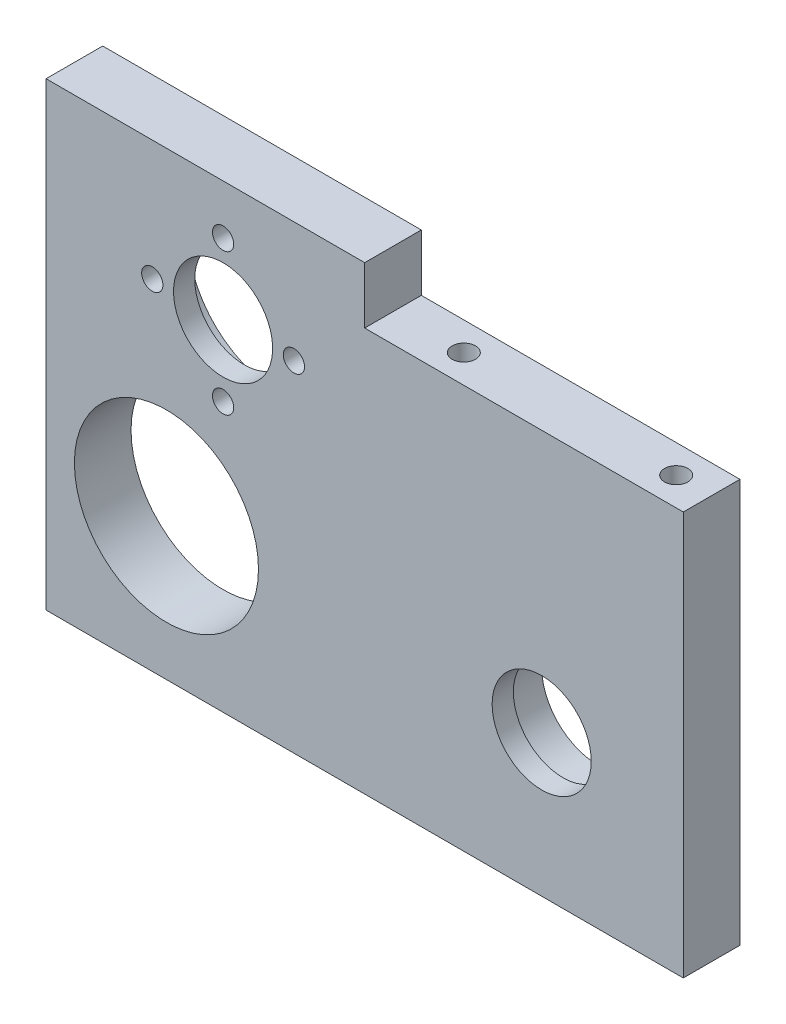
ISO-10303-21;
HEADER;
FILE_DESCRIPTION(('STEP AP214'),'2;1');
FILE_NAME('part.step','',(''),(''),'','','');
FILE_SCHEMA(('AUTOMOTIVE_DESIGN { 1 0 10303 214 1 1 1 1 }'));
ENDSEC;
DATA;
#1=APPLICATION_CONTEXT('core data for automotive mechanical design processes');
#2=APPLICATION_PROTOCOL_DEFINITION('international standard','automotive_design',2000,#1);
#3=PRODUCT_CONTEXT('',#1,'mechanical');
#4=PRODUCT('Part','Part','',(#3));
#5=PRODUCT_RELATED_PRODUCT_CATEGORY('part','',(#4));
#6=PRODUCT_DEFINITION_FORMATION('','',#4);
#7=PRODUCT_DEFINITION_CONTEXT('part definition',#1,'design');
#8=PRODUCT_DEFINITION('design','',#6,#7);
#9=PRODUCT_DEFINITION_SHAPE('','',#8);
#10=(LENGTH_UNIT() NAMED_UNIT(*) SI_UNIT(.MILLI.,.METRE.));
#11=(NAMED_UNIT(*) PLANE_ANGLE_UNIT() SI_UNIT($,.RADIAN.));
#12=(NAMED_UNIT(*) SI_UNIT($,.STERADIAN.) SOLID_ANGLE_UNIT());
#13=UNCERTAINTY_MEASURE_WITH_UNIT(LENGTH_MEASURE(1.E-05),#10,'distance_accuracy_value','');
#14=(GEOMETRIC_REPRESENTATION_CONTEXT(3) GLOBAL_UNCERTAINTY_ASSIGNED_CONTEXT((#13)) GLOBAL_UNIT_ASSIGNED_CONTEXT((#10,
#11,#12)) REPRESENTATION_CONTEXT('',''));
#15=CARTESIAN_POINT('',(0.,0.,0.));
#16=DIRECTION('',(0.,0.,1.));
#17=DIRECTION('',(1.,0.,0.));
#18=AXIS2_PLACEMENT_3D('',#15,#16,#17);
#19=CARTESIAN_POINT('',(70.,20.,8.));
#20=DIRECTION('',(0.,0.,-1.));
#21=DIRECTION('',(-1.,0.,0.));
#22=AXIS2_PLACEMENT_3D('',#19,#20,#21);
#23=CYLINDRICAL_SURFACE('',#22,7.);
#24=CARTESIAN_POINT('',(70.,20.,8.));
#25=DIRECTION('',(0.,0.,1.));
#26=DIRECTION('',(1.,0.,0.));
#27=AXIS2_PLACEMENT_3D('',#24,#25,#26);
#28=CIRCLE('',#27,7.);
#29=CARTESIAN_POINT('',(77.,20.,8.));
#30=VERTEX_POINT('',#29);
#31=EDGE_CURVE('E128',#30,#30,#28,.T.);
#32=ORIENTED_EDGE('',*,*,#31,.T.);
#33=EDGE_LOOP('',(#32));
#34=FACE_BOUND('',#33,.T.);
#35=CARTESIAN_POINT('',(70.,20.,5.));
#36=DIRECTION('',(0.,0.,-1.));
#37=DIRECTION('',(-1.,0.,0.));
#38=AXIS2_PLACEMENT_3D('',#35,#36,#37);
#39=CIRCLE('',#38,7.);
#40=CARTESIAN_POINT('',(63.,20.,5.));
#41=VERTEX_POINT('',#40);
#42=EDGE_CURVE('E36',#41,#41,#39,.T.);
#43=ORIENTED_EDGE('',*,*,#42,.T.);
#44=EDGE_LOOP('',(#43));
#45=FACE_BOUND('',#44,.T.);
#46=ADVANCED_FACE('F32',(#34,#45),#23,.F.);
#47=CARTESIAN_POINT('',(0.,0.,8.));
#48=DIRECTION('',(0.,0.,-1.));
#49=DIRECTION('',(-1.,0.,0.));
#50=AXIS2_PLACEMENT_3D('',#47,#48,#49);
#51=PLANE('',#50);
#52=CARTESIAN_POINT('',(25.,58.,8.));
#53=DIRECTION('',(0.,0.,-1.));
#54=DIRECTION('',(-1.,0.,0.));
#55=AXIS2_PLACEMENT_3D('',#52,#53,#54);
#56=CIRCLE('',#55,1.5);
#57=CARTESIAN_POINT('',(23.5,58.,8.));
#58=VERTEX_POINT('',#57);
#59=EDGE_CURVE('E168',#58,#58,#56,.T.);
#60=ORIENTED_EDGE('',*,*,#59,.T.);
#61=EDGE_LOOP('',(#60));
#62=FACE_BOUND('',#61,.T.);
#63=CARTESIAN_POINT('',(35.,48.,8.));
#64=DIRECTION('',(0.,0.,-1.));
#65=DIRECTION('',(-1.,0.,0.));
#66=AXIS2_PLACEMENT_3D('',#63,#64,#65);
#67=CIRCLE('',#66,1.5);
#68=CARTESIAN_POINT('',(33.5,48.,8.));
#69=VERTEX_POINT('',#68);
#70=EDGE_CURVE('E161',#69,#69,#67,.T.);
#71=ORIENTED_EDGE('',*,*,#70,.T.);
#72=EDGE_LOOP('',(#71));
#73=FACE_BOUND('',#72,.T.);
#74=CARTESIAN_POINT('',(25.,38.,8.));
#75=DIRECTION('',(0.,0.,-1.));
#76=DIRECTION('',(-1.,0.,0.));
#77=AXIS2_PLACEMENT_3D('',#74,#75,#76);
#78=CIRCLE('',#77,1.5);
#79=CARTESIAN_POINT('',(23.5,38.,8.));
#80=VERTEX_POINT('',#79);
#81=EDGE_CURVE('E181',#80,#80,#78,.T.);
#82=ORIENTED_EDGE('',*,*,#81,.T.);
#83=EDGE_LOOP('',(#82));
#84=FACE_BOUND('',#83,.T.);
#85=CARTESIAN_POINT('',(15.,48.,8.));
#86=DIRECTION('',(0.,0.,-1.));
#87=DIRECTION('',(-1.,0.,0.));
#88=AXIS2_PLACEMENT_3D('',#85,#86,#87);
#89=CIRCLE('',#88,1.5);
#90=CARTESIAN_POINT('',(13.5,48.,8.));
#91=VERTEX_POINT('',#90);
#92=EDGE_CURVE('E174',#91,#91,#89,.T.);
#93=ORIENTED_EDGE('',*,*,#92,.T.);
#94=EDGE_LOOP('',(#93));
#95=FACE_BOUND('',#94,.T.);
#96=CARTESIAN_POINT('',(25.,48.,8.));
#97=DIRECTION('',(0.,0.,-1.));
#98=DIRECTION('',(-1.,0.,0.));
#99=AXIS2_PLACEMENT_3D('',#96,#97,#98);
#100=CIRCLE('',#99,7.);
#101=CARTESIAN_POINT('',(18.,48.,8.));
#102=VERTEX_POINT('',#101);
#103=EDGE_CURVE('E186',#102,#102,#100,.T.);
#104=ORIENTED_EDGE('',*,*,#103,.T.);
#105=EDGE_LOOP('',(#104));
#106=FACE_BOUND('',#105,.T.);
#107=DIRECTION('',(-1.,0.,0.));
#108=VECTOR('',#107,1.);
#109=CARTESIAN_POINT('',(90.,57.,8.));
#110=LINE('',#109,#108);
#111=CARTESIAN_POINT('',(90.,57.,8.));
#112=VERTEX_POINT('',#111);
#113=CARTESIAN_POINT('',(45.,57.,8.));
#114=VERTEX_POINT('',#113);
#115=EDGE_CURVE('E95',#112,#114,#110,.T.);
#116=ORIENTED_EDGE('',*,*,#115,.T.);
#117=DIRECTION('',(0.,1.,0.));
#118=VECTOR('',#117,1.);
#119=CARTESIAN_POINT('',(45.,65.,8.));
#120=LINE('',#119,#118);
#121=CARTESIAN_POINT('',(45.,65.,8.));
#122=VERTEX_POINT('',#121);
#123=EDGE_CURVE('E104',#114,#122,#120,.T.);
#124=ORIENTED_EDGE('',*,*,#123,.T.);
#125=DIRECTION('',(-1.,0.,0.));
#126=VECTOR('',#125,1.);
#127=CARTESIAN_POINT('',(0.,65.,8.));
#128=LINE('',#127,#126);
#129=CARTESIAN_POINT('',(0.,65.,8.));
#130=VERTEX_POINT('',#129);
#131=EDGE_CURVE('E57',#122,#130,#128,.T.);
#132=ORIENTED_EDGE('',*,*,#131,.T.);
#133=DIRECTION('',(0.,-1.,0.));
#134=VECTOR('',#133,1.);
#135=CARTESIAN_POINT('',(0.,0.,8.));
#136=LINE('',#135,#134);
#137=CARTESIAN_POINT('',(0.,0.,8.));
#138=VERTEX_POINT('',#137);
#139=EDGE_CURVE('E120',#130,#138,#136,.T.);
#140=ORIENTED_EDGE('',*,*,#139,.T.);
#141=DIRECTION('',(1.,0.,0.));
#142=VECTOR('',#141,1.);
#143=CARTESIAN_POINT('',(0.,0.,8.));
#144=LINE('',#143,#142);
#145=CARTESIAN_POINT('',(90.,0.,8.));
#146=VERTEX_POINT('',#145);
#147=EDGE_CURVE('E80',#138,#146,#144,.T.);
#148=ORIENTED_EDGE('',*,*,#147,.T.);
#149=DIRECTION('',(0.,1.,0.));
#150=VECTOR('',#149,1.);
#151=CARTESIAN_POINT('',(90.,0.,8.));
#152=LINE('',#151,#150);
#153=EDGE_CURVE('E111',#146,#112,#152,.T.);
#154=ORIENTED_EDGE('',*,*,#153,.T.);
#155=EDGE_LOOP('',(#116,#124,#132,#140,#148,#154));
#156=FACE_BOUND('',#155,.T.);
#157=ORIENTED_EDGE('',*,*,#31,.F.);
#158=EDGE_LOOP('',(#157));
#159=FACE_BOUND('',#158,.T.);
#160=CARTESIAN_POINT('',(17.,20.,8.));
#161=DIRECTION('',(0.,0.,1.));
#162=DIRECTION('',(1.,0.,0.));
#163=AXIS2_PLACEMENT_3D('',#160,#161,#162);
#164=CIRCLE('',#163,13.);
#165=CARTESIAN_POINT('',(30.,20.,8.));
#166=VERTEX_POINT('',#165);
#167=EDGE_CURVE('E195',#166,#166,#164,.T.);
#168=ORIENTED_EDGE('',*,*,#167,.F.);
#169=EDGE_LOOP('',(#168));
#170=FACE_BOUND('',#169,.T.);
#171=ADVANCED_FACE('F115',(#62,#73,#84,#95,#106,#156,#159,#170),#51,.F.);
#172=CARTESIAN_POINT('',(0.,0.,0.));
#173=DIRECTION('',(0.,0.,-1.));
#174=DIRECTION('',(-1.,0.,0.));
#175=AXIS2_PLACEMENT_3D('',#172,#173,#174);
#176=PLANE('',#175);
#177=DIRECTION('',(0.,1.,0.));
#178=VECTOR('',#177,1.);
#179=CARTESIAN_POINT('',(45.,65.,0.));
#180=LINE('',#179,#178);
#181=CARTESIAN_POINT('',(45.,57.,0.));
#182=VERTEX_POINT('',#181);
#183=CARTESIAN_POINT('',(45.,65.,0.));
#184=VERTEX_POINT('',#183);
#185=EDGE_CURVE('E48',#182,#184,#180,.T.);
#186=ORIENTED_EDGE('',*,*,#185,.F.);
#187=DIRECTION('',(-1.,0.,0.));
#188=VECTOR('',#187,1.);
#189=CARTESIAN_POINT('',(90.,57.,0.));
#190=LINE('',#189,#188);
#191=CARTESIAN_POINT('',(90.,57.,0.));
#192=VERTEX_POINT('',#191);
#193=EDGE_CURVE('E143',#192,#182,#190,.T.);
#194=ORIENTED_EDGE('',*,*,#193,.F.);
#195=DIRECTION('',(0.,1.,0.));
#196=VECTOR('',#195,1.);
#197=CARTESIAN_POINT('',(90.,0.,0.));
#198=LINE('',#197,#196);
#199=CARTESIAN_POINT('',(90.,0.,0.));
#200=VERTEX_POINT('',#199);
#201=EDGE_CURVE('E113',#200,#192,#198,.T.);
#202=ORIENTED_EDGE('',*,*,#201,.F.);
#203=DIRECTION('',(1.,0.,0.));
#204=VECTOR('',#203,1.);
#205=CARTESIAN_POINT('',(0.,0.,0.));
#206=LINE('',#205,#204);
#207=CARTESIAN_POINT('',(0.,0.,0.));
#208=VERTEX_POINT('',#207);
#209=EDGE_CURVE('E127',#208,#200,#206,.T.);
#210=ORIENTED_EDGE('',*,*,#209,.F.);
#211=DIRECTION('',(0.,-1.,0.));
#212=VECTOR('',#211,1.);
#213=CARTESIAN_POINT('',(0.,0.,0.));
#214=LINE('',#213,#212);
#215=CARTESIAN_POINT('',(0.,65.,0.));
#216=VERTEX_POINT('',#215);
#217=EDGE_CURVE('E124',#216,#208,#214,.T.);
#218=ORIENTED_EDGE('',*,*,#217,.F.);
#219=DIRECTION('',(-1.,0.,0.));
#220=VECTOR('',#219,1.);
#221=CARTESIAN_POINT('',(0.,65.,0.));
#222=LINE('',#221,#220);
#223=EDGE_CURVE('E74',#184,#216,#222,.T.);
#224=ORIENTED_EDGE('',*,*,#223,.F.);
#225=EDGE_LOOP('',(#186,#194,#202,#210,#218,#224));
#226=FACE_BOUND('',#225,.T.);
#227=CARTESIAN_POINT('',(70.,20.,0.));
#228=DIRECTION('',(0.,0.,-1.));
#229=DIRECTION('',(-1.,0.,0.));
#230=AXIS2_PLACEMENT_3D('',#227,#228,#229);
#231=CIRCLE('',#230,8.00000000000001);
#232=CARTESIAN_POINT('',(62.,20.,0.));
#233=VERTEX_POINT('',#232);
#234=EDGE_CURVE('E154',#233,#233,#231,.T.);
#235=ORIENTED_EDGE('',*,*,#234,.F.);
#236=EDGE_LOOP('',(#235));
#237=FACE_BOUND('',#236,.T.);
#238=CARTESIAN_POINT('',(17.,20.,0.));
#239=DIRECTION('',(0.,0.,1.));
#240=DIRECTION('',(1.,0.,0.));
#241=AXIS2_PLACEMENT_3D('',#238,#239,#240);
#242=CIRCLE('',#241,13.);
#243=CARTESIAN_POINT('',(30.,20.,0.));
#244=VERTEX_POINT('',#243);
#245=EDGE_CURVE('E194',#244,#244,#242,.T.);
#246=ORIENTED_EDGE('',*,*,#245,.T.);
#247=EDGE_LOOP('',(#246));
#248=FACE_BOUND('',#247,.T.);
#249=CARTESIAN_POINT('',(25.,48.,0.));
#250=DIRECTION('',(0.,0.,1.));
#251=DIRECTION('',(1.,0.,0.));
#252=AXIS2_PLACEMENT_3D('',#249,#250,#251);
#253=CIRCLE('',#252,13.);
#254=CARTESIAN_POINT('',(38.,48.,0.));
#255=VERTEX_POINT('',#254);
#256=EDGE_CURVE('E189',#255,#255,#253,.T.);
#257=ORIENTED_EDGE('',*,*,#256,.T.);
#258=EDGE_LOOP('',(#257));
#259=FACE_BOUND('',#258,.T.);
#260=ADVANCED_FACE('F141',(#226,#237,#248,#259),#176,.T.);
#261=CARTESIAN_POINT('',(0.,0.,8.));
#262=DIRECTION('',(1.,0.,0.));
#263=DIRECTION('',(0.,0.,-1.));
#264=AXIS2_PLACEMENT_3D('',#261,#262,#263);
#265=PLANE('',#264);
#266=CARTESIAN_POINT('',(0.,7.,4.));
#267=DIRECTION('',(-1.,0.,0.));
#268=DIRECTION('',(0.,0.,1.));
#269=AXIS2_PLACEMENT_3D('',#266,#267,#268);
#270=CIRCLE('',#269,1.65);
#271=CARTESIAN_POINT('',(0.,7.,5.65));
#272=VERTEX_POINT('',#271);
#273=EDGE_CURVE('E252',#272,#272,#270,.T.);
#274=ORIENTED_EDGE('',*,*,#273,.F.);
#275=EDGE_LOOP('',(#274));
#276=FACE_BOUND('',#275,.T.);
#277=CARTESIAN_POINT('',(0.,45.,4.));
#278=DIRECTION('',(-1.,0.,0.));
#279=DIRECTION('',(0.,0.,1.));
#280=AXIS2_PLACEMENT_3D('',#277,#278,#279);
#281=CIRCLE('',#280,1.65);
#282=CARTESIAN_POINT('',(0.,45.,5.65));
#283=VERTEX_POINT('',#282);
#284=EDGE_CURVE('E148',#283,#283,#281,.T.);
#285=ORIENTED_EDGE('',*,*,#284,.F.);
#286=EDGE_LOOP('',(#285));
#287=FACE_BOUND('',#286,.T.);
#288=ORIENTED_EDGE('',*,*,#217,.T.);
#289=DIRECTION('',(0.,0.,-1.));
#290=VECTOR('',#289,1.);
#291=CARTESIAN_POINT('',(0.,0.,8.));
#292=LINE('',#291,#290);
#293=EDGE_CURVE('E41',#138,#208,#292,.T.);
#294=ORIENTED_EDGE('',*,*,#293,.F.);
#295=ORIENTED_EDGE('',*,*,#139,.F.);
#296=DIRECTION('',(0.,0.,-1.));
#297=VECTOR('',#296,1.);
#298=CARTESIAN_POINT('',(0.,65.,8.));
#299=LINE('',#298,#297);
#300=EDGE_CURVE('E118',#130,#216,#299,.T.);
#301=ORIENTED_EDGE('',*,*,#300,.T.);
#302=EDGE_LOOP('',(#288,#294,#295,#301));
#303=FACE_BOUND('',#302,.T.);
#304=ADVANCED_FACE('F34',(#276,#287,#303),#265,.F.);
#305=CARTESIAN_POINT('',(0.,0.,8.));
#306=DIRECTION('',(0.,1.,0.));
#307=DIRECTION('',(0.,0.,1.));
#308=AXIS2_PLACEMENT_3D('',#305,#306,#307);
#309=PLANE('',#308);
#310=ORIENTED_EDGE('',*,*,#209,.T.);
#311=DIRECTION('',(0.,0.,-1.));
#312=VECTOR('',#311,1.);
#313=CARTESIAN_POINT('',(90.,0.,8.));
#314=LINE('',#313,#312);
#315=EDGE_CURVE('E133',#146,#200,#314,.T.);
#316=ORIENTED_EDGE('',*,*,#315,.F.);
#317=ORIENTED_EDGE('',*,*,#147,.F.);
#318=ORIENTED_EDGE('',*,*,#293,.T.);
#319=EDGE_LOOP('',(#310,#316,#317,#318));
#320=FACE_BOUND('',#319,.T.);
#321=ADVANCED_FACE('F136',(#320),#309,.F.);
#322=CARTESIAN_POINT('',(90.,0.,8.));
#323=DIRECTION('',(-1.,0.,0.));
#324=DIRECTION('',(0.,0.,1.));
#325=AXIS2_PLACEMENT_3D('',#322,#323,#324);
#326=PLANE('',#325);
#327=ORIENTED_EDGE('',*,*,#201,.T.);
#328=DIRECTION('',(0.,0.,-1.));
#329=VECTOR('',#328,1.);
#330=CARTESIAN_POINT('',(90.,57.,8.));
#331=LINE('',#330,#329);
#332=EDGE_CURVE('E99',#112,#192,#331,.T.);
#333=ORIENTED_EDGE('',*,*,#332,.F.);
#334=ORIENTED_EDGE('',*,*,#153,.F.);
#335=ORIENTED_EDGE('',*,*,#315,.T.);
#336=EDGE_LOOP('',(#327,#333,#334,#335));
#337=FACE_BOUND('',#336,.T.);
#338=ADVANCED_FACE('F109',(#337),#326,.F.);
#339=CARTESIAN_POINT('',(0.,65.,8.));
#340=DIRECTION('',(0.,-1.,0.));
#341=DIRECTION('',(0.,0.,-1.));
#342=AXIS2_PLACEMENT_3D('',#339,#340,#341);
#343=PLANE('',#342);
#344=ORIENTED_EDGE('',*,*,#131,.F.);
#345=DIRECTION('',(0.,0.,-1.));
#346=VECTOR('',#345,1.);
#347=CARTESIAN_POINT('',(45.,65.,8.));
#348=LINE('',#347,#346);
#349=EDGE_CURVE('E152',#122,#184,#348,.T.);
#350=ORIENTED_EDGE('',*,*,#349,.T.);
#351=ORIENTED_EDGE('',*,*,#223,.T.);
#352=ORIENTED_EDGE('',*,*,#300,.F.);
#353=EDGE_LOOP('',(#344,#350,#351,#352));
#354=FACE_BOUND('',#353,.T.);
#355=ADVANCED_FACE('F214',(#354),#343,.F.);
#356=CARTESIAN_POINT('',(17.,20.,8.));
#357=DIRECTION('',(0.,0.,-1.));
#358=DIRECTION('',(-1.,0.,0.));
#359=AXIS2_PLACEMENT_3D('',#356,#357,#358);
#360=CYLINDRICAL_SURFACE('',#359,13.);
#361=ORIENTED_EDGE('',*,*,#167,.T.);
#362=EDGE_LOOP('',(#361));
#363=FACE_BOUND('',#362,.T.);
#364=ORIENTED_EDGE('',*,*,#245,.F.);
#365=EDGE_LOOP('',(#364));
#366=FACE_BOUND('',#365,.T.);
#367=ADVANCED_FACE('F210',(#363,#366),#360,.F.);
#368=CARTESIAN_POINT('',(25.,48.,8.));
#369=DIRECTION('',(0.,0.,-1.));
#370=DIRECTION('',(-1.,0.,0.));
#371=AXIS2_PLACEMENT_3D('',#368,#369,#370);
#372=CYLINDRICAL_SURFACE('',#371,13.);
#373=CARTESIAN_POINT('',(25.,48.,5.));
#374=DIRECTION('',(0.,0.,-1.));
#375=DIRECTION('',(-1.,0.,0.));
#376=AXIS2_PLACEMENT_3D('',#373,#374,#375);
#377=CIRCLE('',#376,13.);
#378=CARTESIAN_POINT('',(12.,48.,5.));
#379=VERTEX_POINT('',#378);
#380=EDGE_CURVE('E11',#379,#379,#377,.T.);
#381=ORIENTED_EDGE('',*,*,#380,.F.);
#382=EDGE_LOOP('',(#381));
#383=FACE_BOUND('',#382,.T.);
#384=ORIENTED_EDGE('',*,*,#256,.F.);
#385=EDGE_LOOP('',(#384));
#386=FACE_BOUND('',#385,.T.);
#387=ADVANCED_FACE('F213',(#383,#386),#372,.F.);
#388=CARTESIAN_POINT('',(25.,48.,5.));
#389=DIRECTION('',(0.,0.,-1.));
#390=DIRECTION('',(-1.,0.,0.));
#391=AXIS2_PLACEMENT_3D('',#388,#389,#390);
#392=PLANE('',#391);
#393=CARTESIAN_POINT('',(25.,58.,5.));
#394=DIRECTION('',(0.,0.,-1.));
#395=DIRECTION('',(-1.,0.,0.));
#396=AXIS2_PLACEMENT_3D('',#393,#394,#395);
#397=CIRCLE('',#396,1.5);
#398=CARTESIAN_POINT('',(23.5,58.,5.));
#399=VERTEX_POINT('',#398);
#400=EDGE_CURVE('E171',#399,#399,#397,.T.);
#401=ORIENTED_EDGE('',*,*,#400,.F.);
#402=EDGE_LOOP('',(#401));
#403=FACE_BOUND('',#402,.T.);
#404=CARTESIAN_POINT('',(35.,48.,5.));
#405=DIRECTION('',(0.,0.,-1.));
#406=DIRECTION('',(-1.,0.,0.));
#407=AXIS2_PLACEMENT_3D('',#404,#405,#406);
#408=CIRCLE('',#407,1.5);
#409=CARTESIAN_POINT('',(33.5,48.,5.));
#410=VERTEX_POINT('',#409);
#411=EDGE_CURVE('E165',#410,#410,#408,.T.);
#412=ORIENTED_EDGE('',*,*,#411,.F.);
#413=EDGE_LOOP('',(#412));
#414=FACE_BOUND('',#413,.T.);
#415=CARTESIAN_POINT('',(25.,38.,5.));
#416=DIRECTION('',(0.,0.,-1.));
#417=DIRECTION('',(-1.,0.,0.));
#418=AXIS2_PLACEMENT_3D('',#415,#416,#417);
#419=CIRCLE('',#418,1.5);
#420=CARTESIAN_POINT('',(23.5,38.,5.));
#421=VERTEX_POINT('',#420);
#422=EDGE_CURVE('E164',#421,#421,#419,.T.);
#423=ORIENTED_EDGE('',*,*,#422,.F.);
#424=EDGE_LOOP('',(#423));
#425=FACE_BOUND('',#424,.T.);
#426=CARTESIAN_POINT('',(15.,48.,5.));
#427=DIRECTION('',(0.,0.,-1.));
#428=DIRECTION('',(-1.,0.,0.));
#429=AXIS2_PLACEMENT_3D('',#426,#427,#428);
#430=CIRCLE('',#429,1.5);
#431=CARTESIAN_POINT('',(13.5,48.,5.));
#432=VERTEX_POINT('',#431);
#433=EDGE_CURVE('E178',#432,#432,#430,.T.);
#434=ORIENTED_EDGE('',*,*,#433,.F.);
#435=EDGE_LOOP('',(#434));
#436=FACE_BOUND('',#435,.T.);
#437=CARTESIAN_POINT('',(25.,48.,5.));
#438=DIRECTION('',(0.,0.,-1.));
#439=DIRECTION('',(-1.,0.,0.));
#440=AXIS2_PLACEMENT_3D('',#437,#438,#439);
#441=CIRCLE('',#440,7.);
#442=CARTESIAN_POINT('',(18.,48.,5.));
#443=VERTEX_POINT('',#442);
#444=EDGE_CURVE('E177',#443,#443,#441,.T.);
#445=ORIENTED_EDGE('',*,*,#444,.F.);
#446=EDGE_LOOP('',(#445));
#447=FACE_BOUND('',#446,.T.);
#448=ORIENTED_EDGE('',*,*,#380,.T.);
#449=EDGE_LOOP('',(#448));
#450=FACE_BOUND('',#449,.T.);
#451=ADVANCED_FACE('F224',(#403,#414,#425,#436,#447,#450),#392,.T.);
#452=CARTESIAN_POINT('',(25.,48.,8.));
#453=DIRECTION('',(0.,0.,-1.));
#454=DIRECTION('',(-1.,0.,0.));
#455=AXIS2_PLACEMENT_3D('',#452,#453,#454);
#456=CYLINDRICAL_SURFACE('',#455,7.);
#457=ORIENTED_EDGE('',*,*,#103,.F.);
#458=EDGE_LOOP('',(#457));
#459=FACE_BOUND('',#458,.T.);
#460=ORIENTED_EDGE('',*,*,#444,.T.);
#461=EDGE_LOOP('',(#460));
#462=FACE_BOUND('',#461,.T.);
#463=ADVANCED_FACE('F230',(#459,#462),#456,.F.);
#464=CARTESIAN_POINT('',(15.,48.,8.));
#465=DIRECTION('',(0.,0.,-1.));
#466=DIRECTION('',(-1.,0.,0.));
#467=AXIS2_PLACEMENT_3D('',#464,#465,#466);
#468=CYLINDRICAL_SURFACE('',#467,1.5);
#469=ORIENTED_EDGE('',*,*,#92,.F.);
#470=EDGE_LOOP('',(#469));
#471=FACE_BOUND('',#470,.T.);
#472=ORIENTED_EDGE('',*,*,#433,.T.);
#473=EDGE_LOOP('',(#472));
#474=FACE_BOUND('',#473,.T.);
#475=ADVANCED_FACE('F336',(#471,#474),#468,.F.);
#476=CARTESIAN_POINT('',(25.,38.,8.));
#477=DIRECTION('',(0.,0.,-1.));
#478=DIRECTION('',(-1.,0.,0.));
#479=AXIS2_PLACEMENT_3D('',#476,#477,#478);
#480=CYLINDRICAL_SURFACE('',#479,1.5);
#481=ORIENTED_EDGE('',*,*,#81,.F.);
#482=EDGE_LOOP('',(#481));
#483=FACE_BOUND('',#482,.T.);
#484=ORIENTED_EDGE('',*,*,#422,.T.);
#485=EDGE_LOOP('',(#484));
#486=FACE_BOUND('',#485,.T.);
#487=ADVANCED_FACE('F331',(#483,#486),#480,.F.);
#488=CARTESIAN_POINT('',(35.,48.,8.));
#489=DIRECTION('',(0.,0.,-1.));
#490=DIRECTION('',(-1.,0.,0.));
#491=AXIS2_PLACEMENT_3D('',#488,#489,#490);
#492=CYLINDRICAL_SURFACE('',#491,1.5);
#493=ORIENTED_EDGE('',*,*,#70,.F.);
#494=EDGE_LOOP('',(#493));
#495=FACE_BOUND('',#494,.T.);
#496=ORIENTED_EDGE('',*,*,#411,.T.);
#497=EDGE_LOOP('',(#496));
#498=FACE_BOUND('',#497,.T.);
#499=ADVANCED_FACE('F328',(#495,#498),#492,.F.);
#500=CARTESIAN_POINT('',(25.,58.,8.));
#501=DIRECTION('',(0.,0.,-1.));
#502=DIRECTION('',(-1.,0.,0.));
#503=AXIS2_PLACEMENT_3D('',#500,#501,#502);
#504=CYLINDRICAL_SURFACE('',#503,1.5);
#505=ORIENTED_EDGE('',*,*,#59,.F.);
#506=EDGE_LOOP('',(#505));
#507=FACE_BOUND('',#506,.T.);
#508=ORIENTED_EDGE('',*,*,#400,.T.);
#509=EDGE_LOOP('',(#508));
#510=FACE_BOUND('',#509,.T.);
#511=ADVANCED_FACE('F326',(#507,#510),#504,.F.);
#512=CARTESIAN_POINT('',(70.,20.,5.));
#513=DIRECTION('',(0.,0.,-1.));
#514=DIRECTION('',(-1.,0.,0.));
#515=AXIS2_PLACEMENT_3D('',#512,#513,#514);
#516=CYLINDRICAL_SURFACE('',#515,8.00000000000001);
#517=CARTESIAN_POINT('',(70.,20.,5.));
#518=DIRECTION('',(0.,0.,-1.));
#519=DIRECTION('',(-1.,0.,0.));
#520=AXIS2_PLACEMENT_3D('',#517,#518,#519);
#521=CIRCLE('',#520,8.00000000000001);
#522=CARTESIAN_POINT('',(62.,20.,5.));
#523=VERTEX_POINT('',#522);
#524=EDGE_CURVE('E156',#523,#523,#521,.T.);
#525=ORIENTED_EDGE('',*,*,#524,.F.);
#526=EDGE_LOOP('',(#525));
#527=FACE_BOUND('',#526,.T.);
#528=ORIENTED_EDGE('',*,*,#234,.T.);
#529=EDGE_LOOP('',(#528));
#530=FACE_BOUND('',#529,.T.);
#531=ADVANCED_FACE('F322',(#527,#530),#516,.F.);
#532=CARTESIAN_POINT('',(70.,20.,5.));
#533=DIRECTION('',(0.,0.,-1.));
#534=DIRECTION('',(-1.,0.,0.));
#535=AXIS2_PLACEMENT_3D('',#532,#533,#534);
#536=PLANE('',#535);
#537=ORIENTED_EDGE('',*,*,#42,.F.);
#538=EDGE_LOOP('',(#537));
#539=FACE_BOUND('',#538,.T.);
#540=ORIENTED_EDGE('',*,*,#524,.T.);
#541=EDGE_LOOP('',(#540));
#542=FACE_BOUND('',#541,.T.);
#543=ADVANCED_FACE('F318',(#539,#542),#536,.T.);
#544=CARTESIAN_POINT('',(45.,65.,8.));
#545=DIRECTION('',(-1.,0.,0.));
#546=DIRECTION('',(0.,0.,1.));
#547=AXIS2_PLACEMENT_3D('',#544,#545,#546);
#548=PLANE('',#547);
#549=ORIENTED_EDGE('',*,*,#185,.T.);
#550=ORIENTED_EDGE('',*,*,#349,.F.);
#551=ORIENTED_EDGE('',*,*,#123,.F.);
#552=DIRECTION('',(0.,0.,-1.));
#553=VECTOR('',#552,1.);
#554=CARTESIAN_POINT('',(45.,57.,8.));
#555=LINE('',#554,#553);
#556=EDGE_CURVE('E101',#114,#182,#555,.T.);
#557=ORIENTED_EDGE('',*,*,#556,.T.);
#558=EDGE_LOOP('',(#549,#550,#551,#557));
#559=FACE_BOUND('',#558,.T.);
#560=ADVANCED_FACE('F287',(#559),#548,.F.);
#561=CARTESIAN_POINT('',(90.,57.,8.));
#562=DIRECTION('',(0.,-1.,0.));
#563=DIRECTION('',(0.,0.,-1.));
#564=AXIS2_PLACEMENT_3D('',#561,#562,#563);
#565=PLANE('',#564);
#566=CARTESIAN_POINT('',(55.,57.,4.));
#567=DIRECTION('',(0.,1.,0.));
#568=DIRECTION('',(0.,0.,1.));
#569=AXIS2_PLACEMENT_3D('',#566,#567,#568);
#570=CIRCLE('',#569,1.65);
#571=CARTESIAN_POINT('',(55.,57.,5.65));
#572=VERTEX_POINT('',#571);
#573=EDGE_CURVE('E269',#572,#572,#570,.T.);
#574=ORIENTED_EDGE('',*,*,#573,.F.);
#575=EDGE_LOOP('',(#574));
#576=FACE_BOUND('',#575,.T.);
#577=CARTESIAN_POINT('',(85.,57.,4.));
#578=DIRECTION('',(0.,1.,0.));
#579=DIRECTION('',(0.,0.,1.));
#580=AXIS2_PLACEMENT_3D('',#577,#578,#579);
#581=CIRCLE('',#580,1.65);
#582=CARTESIAN_POINT('',(85.,57.,5.65));
#583=VERTEX_POINT('',#582);
#584=EDGE_CURVE('E263',#583,#583,#581,.T.);
#585=ORIENTED_EDGE('',*,*,#584,.F.);
#586=EDGE_LOOP('',(#585));
#587=FACE_BOUND('',#586,.T.);
#588=ORIENTED_EDGE('',*,*,#193,.T.);
#589=ORIENTED_EDGE('',*,*,#556,.F.);
#590=ORIENTED_EDGE('',*,*,#115,.F.);
#591=ORIENTED_EDGE('',*,*,#332,.T.);
#592=EDGE_LOOP('',(#588,#589,#590,#591));
#593=FACE_BOUND('',#592,.T.);
#594=ADVANCED_FACE('F98',(#576,#587,#593),#565,.F.);
#595=CARTESIAN_POINT('',(10.,45.,4.));
#596=DIRECTION('',(-1.,0.,0.));
#597=DIRECTION('',(0.,0.,1.));
#598=AXIS2_PLACEMENT_3D('',#595,#596,#597);
#599=CYLINDRICAL_SURFACE('',#598,1.65);
#600=CARTESIAN_POINT('',(10.,45.,4.));
#601=DIRECTION('',(-1.,0.,0.));
#602=DIRECTION('',(0.,0.,1.));
#603=AXIS2_PLACEMENT_3D('',#600,#601,#602);
#604=CIRCLE('',#603,1.65);
#605=CARTESIAN_POINT('',(10.,45.,5.65));
#606=VERTEX_POINT('',#605);
#607=EDGE_CURVE('E144',#606,#606,#604,.T.);
#608=ORIENTED_EDGE('',*,*,#607,.F.);
#609=EDGE_LOOP('',(#608));
#610=FACE_BOUND('',#609,.T.);
#611=ORIENTED_EDGE('',*,*,#284,.T.);
#612=EDGE_LOOP('',(#611));
#613=FACE_BOUND('',#612,.T.);
#614=ADVANCED_FACE('F286',(#610,#613),#599,.F.);
#615=CARTESIAN_POINT('',(10.,45.,4.));
#616=DIRECTION('',(-1.,0.,0.));
#617=DIRECTION('',(0.,0.,1.));
#618=AXIS2_PLACEMENT_3D('',#615,#616,#617);
#619=PLANE('',#618);
#620=ORIENTED_EDGE('',*,*,#607,.T.);
#621=EDGE_LOOP('',(#620));
#622=FACE_BOUND('',#621,.T.);
#623=ADVANCED_FACE('F309',(#622),#619,.T.);
#624=CARTESIAN_POINT('',(10.,7.,4.));
#625=DIRECTION('',(-1.,0.,0.));
#626=DIRECTION('',(0.,0.,1.));
#627=AXIS2_PLACEMENT_3D('',#624,#625,#626);
#628=CYLINDRICAL_SURFACE('',#627,1.65);
#629=CARTESIAN_POINT('',(10.,7.,4.));
#630=DIRECTION('',(-1.,0.,0.));
#631=DIRECTION('',(0.,0.,1.));
#632=AXIS2_PLACEMENT_3D('',#629,#630,#631);
#633=CIRCLE('',#632,1.65);
#634=CARTESIAN_POINT('',(10.,7.,5.65));
#635=VERTEX_POINT('',#634);
#636=EDGE_CURVE('E256',#635,#635,#633,.T.);
#637=ORIENTED_EDGE('',*,*,#636,.F.);
#638=EDGE_LOOP('',(#637));
#639=FACE_BOUND('',#638,.T.);
#640=ORIENTED_EDGE('',*,*,#273,.T.);
#641=EDGE_LOOP('',(#640));
#642=FACE_BOUND('',#641,.T.);
#643=ADVANCED_FACE('F302',(#639,#642),#628,.F.);
#644=CARTESIAN_POINT('',(10.,7.,4.));
#645=DIRECTION('',(-1.,0.,0.));
#646=DIRECTION('',(0.,0.,1.));
#647=AXIS2_PLACEMENT_3D('',#644,#645,#646);
#648=PLANE('',#647);
#649=ORIENTED_EDGE('',*,*,#636,.T.);
#650=EDGE_LOOP('',(#649));
#651=FACE_BOUND('',#650,.T.);
#652=ADVANCED_FACE('F293',(#651),#648,.T.);
#653=CARTESIAN_POINT('',(85.,47.,4.));
#654=DIRECTION('',(0.,1.,0.));
#655=DIRECTION('',(0.,0.,1.));
#656=AXIS2_PLACEMENT_3D('',#653,#654,#655);
#657=CYLINDRICAL_SURFACE('',#656,1.65);
#658=CARTESIAN_POINT('',(85.,47.,4.));
#659=DIRECTION('',(0.,1.,0.));
#660=DIRECTION('',(0.,0.,1.));
#661=AXIS2_PLACEMENT_3D('',#658,#659,#660);
#662=CIRCLE('',#661,1.65);
#663=CARTESIAN_POINT('',(85.,47.,5.65));
#664=VERTEX_POINT('',#663);
#665=EDGE_CURVE('E261',#664,#664,#662,.T.);
#666=ORIENTED_EDGE('',*,*,#665,.F.);
#667=EDGE_LOOP('',(#666));
#668=FACE_BOUND('',#667,.T.);
#669=ORIENTED_EDGE('',*,*,#584,.T.);
#670=EDGE_LOOP('',(#669));
#671=FACE_BOUND('',#670,.T.);
#672=ADVANCED_FACE('F291',(#668,#671),#657,.F.);
#673=CARTESIAN_POINT('',(85.,47.,4.));
#674=DIRECTION('',(0.,1.,0.));
#675=DIRECTION('',(0.,0.,1.));
#676=AXIS2_PLACEMENT_3D('',#673,#674,#675);
#677=PLANE('',#676);
#678=ORIENTED_EDGE('',*,*,#665,.T.);
#679=EDGE_LOOP('',(#678));
#680=FACE_BOUND('',#679,.T.);
#681=ADVANCED_FACE('F280',(#680),#677,.T.);
#682=CARTESIAN_POINT('',(55.,47.,4.));
#683=DIRECTION('',(0.,1.,0.));
#684=DIRECTION('',(0.,0.,1.));
#685=AXIS2_PLACEMENT_3D('',#682,#683,#684);
#686=CYLINDRICAL_SURFACE('',#685,1.65);
#687=CARTESIAN_POINT('',(55.,47.,4.));
#688=DIRECTION('',(0.,1.,0.));
#689=DIRECTION('',(0.,0.,1.));
#690=AXIS2_PLACEMENT_3D('',#687,#688,#689);
#691=CIRCLE('',#690,1.65);
#692=CARTESIAN_POINT('',(55.,47.,5.65));
#693=VERTEX_POINT('',#692);
#694=EDGE_CURVE('E266',#693,#693,#691,.T.);
#695=ORIENTED_EDGE('',*,*,#694,.F.);
#696=EDGE_LOOP('',(#695));
#697=FACE_BOUND('',#696,.T.);
#698=ORIENTED_EDGE('',*,*,#573,.T.);
#699=EDGE_LOOP('',(#698));
#700=FACE_BOUND('',#699,.T.);
#701=ADVANCED_FACE('F277',(#697,#700),#686,.F.);
#702=CARTESIAN_POINT('',(55.,47.,4.));
#703=DIRECTION('',(0.,1.,0.));
#704=DIRECTION('',(0.,0.,1.));
#705=AXIS2_PLACEMENT_3D('',#702,#703,#704);
#706=PLANE('',#705);
#707=ORIENTED_EDGE('',*,*,#694,.T.);
#708=EDGE_LOOP('',(#707));
#709=FACE_BOUND('',#708,.T.);
#710=ADVANCED_FACE('F275',(#709),#706,.T.);
#711=CLOSED_SHELL('',(#46,#171,#260,#304,#321,#338,#355,#367,#387,#451,#463,#475,#487,#499,#511,
#531,#543,#560,#594,#614,#623,#643,#652,#672,#681,#701,#710));
#712=MANIFOLD_SOLID_BREP('B2',#711);
#713=ADVANCED_BREP_SHAPE_REPRESENTATION('',(#18,#712),#14);
#714=SHAPE_DEFINITION_REPRESENTATION(#9,#713);
ENDSEC;
END-ISO-10303-21;
